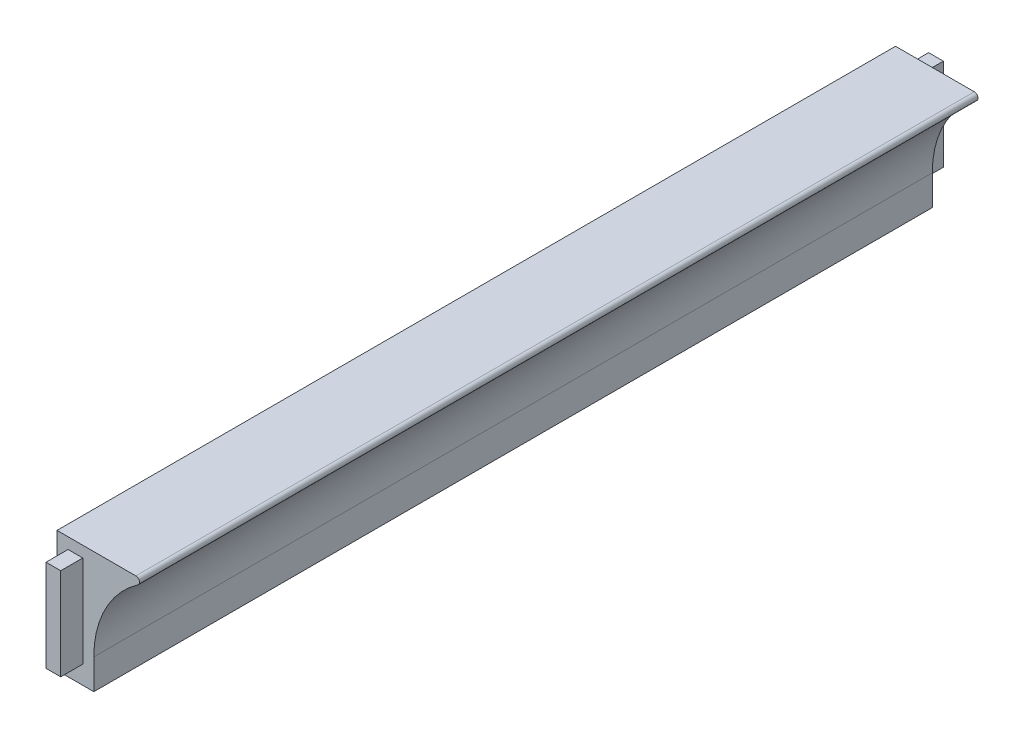
ISO-10303-21;
HEADER;
FILE_DESCRIPTION(('STEP AP214'),'2;1');
FILE_NAME('part.step','',(''),(''),'','','');
FILE_SCHEMA(('AUTOMOTIVE_DESIGN { 1 0 10303 214 1 1 1 1 }'));
ENDSEC;
DATA;
#1=APPLICATION_CONTEXT('core data for automotive mechanical design processes');
#2=APPLICATION_PROTOCOL_DEFINITION('international standard','automotive_design',2000,#1);
#3=PRODUCT_CONTEXT('',#1,'mechanical');
#4=PRODUCT('Part','Part','',(#3));
#5=PRODUCT_RELATED_PRODUCT_CATEGORY('part','',(#4));
#6=PRODUCT_DEFINITION_FORMATION('','',#4);
#7=PRODUCT_DEFINITION_CONTEXT('part definition',#1,'design');
#8=PRODUCT_DEFINITION('design','',#6,#7);
#9=PRODUCT_DEFINITION_SHAPE('','',#8);
#10=(LENGTH_UNIT() NAMED_UNIT(*) SI_UNIT(.MILLI.,.METRE.));
#11=(NAMED_UNIT(*) PLANE_ANGLE_UNIT() SI_UNIT($,.RADIAN.));
#12=(NAMED_UNIT(*) SI_UNIT($,.STERADIAN.) SOLID_ANGLE_UNIT());
#13=UNCERTAINTY_MEASURE_WITH_UNIT(LENGTH_MEASURE(1.E-05),#10,'distance_accuracy_value','');
#14=(GEOMETRIC_REPRESENTATION_CONTEXT(3) GLOBAL_UNCERTAINTY_ASSIGNED_CONTEXT((#13)) GLOBAL_UNIT_ASSIGNED_CONTEXT((#10,
#11,#12)) REPRESENTATION_CONTEXT('',''));
#15=CARTESIAN_POINT('',(0.,0.,0.));
#16=DIRECTION('',(0.,0.,1.));
#17=DIRECTION('',(1.,0.,0.));
#18=AXIS2_PLACEMENT_3D('',#15,#16,#17);
#19=CARTESIAN_POINT('',(0.,0.,120.));
#20=DIRECTION('',(0.,0.,1.));
#21=DIRECTION('',(1.,0.,0.));
#22=AXIS2_PLACEMENT_3D('',#19,#20,#21);
#23=PLANE('',#22);
#24=DIRECTION('',(0.,-1.,0.));
#25=VECTOR('',#24,1.);
#26=CARTESIAN_POINT('',(-18.,-3.,120.));
#27=LINE('',#26,#25);
#28=CARTESIAN_POINT('',(-18.,-28.,120.));
#29=VERTEX_POINT('',#28);
#30=CARTESIAN_POINT('',(-18.,-3.,120.));
#31=VERTEX_POINT('',#30);
#32=EDGE_CURVE('E214',#29,#31,#27,.F.);
#33=ORIENTED_EDGE('',*,*,#32,.T.);
#34=DIRECTION('',(1.,0.,0.));
#35=VECTOR('',#34,1.);
#36=CARTESIAN_POINT('',(-22.,-3.,120.));
#37=LINE('',#36,#35);
#38=CARTESIAN_POINT('',(-22.,-3.,120.));
#39=VERTEX_POINT('',#38);
#40=EDGE_CURVE('E209',#31,#39,#37,.F.);
#41=ORIENTED_EDGE('',*,*,#40,.T.);
#42=DIRECTION('',(0.,1.,0.));
#43=VECTOR('',#42,1.);
#44=CARTESIAN_POINT('',(-22.,-3.,120.));
#45=LINE('',#44,#43);
#46=CARTESIAN_POINT('',(-22.,-28.,120.));
#47=VERTEX_POINT('',#46);
#48=EDGE_CURVE('E203',#39,#47,#45,.F.);
#49=ORIENTED_EDGE('',*,*,#48,.T.);
#50=DIRECTION('',(1.,0.,0.));
#51=VECTOR('',#50,1.);
#52=CARTESIAN_POINT('',(-22.,-28.,120.));
#53=LINE('',#52,#51);
#54=EDGE_CURVE('E219',#47,#29,#53,.T.);
#55=ORIENTED_EDGE('',*,*,#54,.T.);
#56=EDGE_LOOP('',(#33,#41,#49,#55));
#57=FACE_BOUND('',#56,.T.);
#58=ADVANCED_FACE('F17',(#57),#23,.T.);
#59=CARTESIAN_POINT('',(0.,0.,-120.));
#60=DIRECTION('',(0.,0.,-1.));
#61=DIRECTION('',(-1.,0.,0.));
#62=AXIS2_PLACEMENT_3D('',#59,#60,#61);
#63=PLANE('',#62);
#64=DIRECTION('',(0.,1.,0.));
#65=VECTOR('',#64,1.);
#66=CARTESIAN_POINT('',(-18.,-3.,-120.));
#67=LINE('',#66,#65);
#68=CARTESIAN_POINT('',(-18.,-28.,-120.));
#69=VERTEX_POINT('',#68);
#70=CARTESIAN_POINT('',(-18.,-3.,-120.));
#71=VERTEX_POINT('',#70);
#72=EDGE_CURVE('E176',#69,#71,#67,.T.);
#73=ORIENTED_EDGE('',*,*,#72,.F.);
#74=DIRECTION('',(1.,0.,0.));
#75=VECTOR('',#74,1.);
#76=CARTESIAN_POINT('',(-22.,-28.,-120.));
#77=LINE('',#76,#75);
#78=CARTESIAN_POINT('',(-22.,-28.,-120.));
#79=VERTEX_POINT('',#78);
#80=EDGE_CURVE('E181',#79,#69,#77,.T.);
#81=ORIENTED_EDGE('',*,*,#80,.F.);
#82=DIRECTION('',(0.,-1.,0.));
#83=VECTOR('',#82,1.);
#84=CARTESIAN_POINT('',(-22.,-3.,-120.));
#85=LINE('',#84,#83);
#86=CARTESIAN_POINT('',(-22.,-3.,-120.));
#87=VERTEX_POINT('',#86);
#88=EDGE_CURVE('E186',#87,#79,#85,.T.);
#89=ORIENTED_EDGE('',*,*,#88,.F.);
#90=DIRECTION('',(-1.,0.,0.));
#91=VECTOR('',#90,1.);
#92=CARTESIAN_POINT('',(-22.,-3.,-120.));
#93=LINE('',#92,#91);
#94=EDGE_CURVE('E171',#71,#87,#93,.T.);
#95=ORIENTED_EDGE('',*,*,#94,.F.);
#96=EDGE_LOOP('',(#73,#81,#89,#95));
#97=FACE_BOUND('',#96,.T.);
#98=ADVANCED_FACE('F327',(#97),#63,.T.);
#99=CARTESIAN_POINT('',(-22.,-28.,120.));
#100=DIRECTION('',(0.,1.,0.));
#101=DIRECTION('',(0.,0.,1.));
#102=AXIS2_PLACEMENT_3D('',#99,#100,#101);
#103=PLANE('',#102);
#104=DIRECTION('',(0.,0.,1.));
#105=VECTOR('',#104,1.);
#106=CARTESIAN_POINT('',(-18.,-28.,120.));
#107=LINE('',#106,#105);
#108=CARTESIAN_POINT('',(-18.,-28.,114.));
#109=VERTEX_POINT('',#108);
#110=EDGE_CURVE('E216',#109,#29,#107,.T.);
#111=ORIENTED_EDGE('',*,*,#110,.T.);
#112=ORIENTED_EDGE('',*,*,#54,.F.);
#113=DIRECTION('',(0.,0.,1.));
#114=VECTOR('',#113,1.);
#115=CARTESIAN_POINT('',(-22.,-28.,120.));
#116=LINE('',#115,#114);
#117=CARTESIAN_POINT('',(-22.,-28.,114.));
#118=VERTEX_POINT('',#117);
#119=EDGE_CURVE('E188',#47,#118,#116,.F.);
#120=ORIENTED_EDGE('',*,*,#119,.T.);
#121=DIRECTION('',(-1.,0.,0.));
#122=VECTOR('',#121,1.);
#123=CARTESIAN_POINT('',(13.,-28.,114.));
#124=LINE('',#123,#122);
#125=EDGE_CURVE('E136',#118,#109,#124,.F.);
#126=ORIENTED_EDGE('',*,*,#125,.T.);
#127=EDGE_LOOP('',(#111,#112,#120,#126));
#128=FACE_BOUND('',#127,.T.);
#129=ADVANCED_FACE('F251',(#128),#103,.F.);
#130=CARTESIAN_POINT('',(-18.,-3.,120.));
#131=DIRECTION('',(-1.,0.,0.));
#132=DIRECTION('',(0.,-1.,0.));
#133=AXIS2_PLACEMENT_3D('',#130,#131,#132);
#134=PLANE('',#133);
#135=DIRECTION('',(0.,0.,1.));
#136=VECTOR('',#135,1.);
#137=CARTESIAN_POINT('',(-18.,-3.,120.));
#138=LINE('',#137,#136);
#139=CARTESIAN_POINT('',(-18.,-3.,114.));
#140=VERTEX_POINT('',#139);
#141=EDGE_CURVE('E211',#140,#31,#138,.T.);
#142=ORIENTED_EDGE('',*,*,#141,.T.);
#143=ORIENTED_EDGE('',*,*,#32,.F.);
#144=ORIENTED_EDGE('',*,*,#110,.F.);
#145=DIRECTION('',(0.,1.,0.));
#146=VECTOR('',#145,1.);
#147=CARTESIAN_POINT('',(-18.,-24.7991935352745,114.));
#148=LINE('',#147,#146);
#149=EDGE_CURVE('E245',#109,#140,#148,.T.);
#150=ORIENTED_EDGE('',*,*,#149,.T.);
#151=EDGE_LOOP('',(#142,#143,#144,#150));
#152=FACE_BOUND('',#151,.T.);
#153=ADVANCED_FACE('F260',(#152),#134,.F.);
#154=CARTESIAN_POINT('',(-22.,-3.,120.));
#155=DIRECTION('',(0.,-1.,0.));
#156=DIRECTION('',(1.,0.,0.));
#157=AXIS2_PLACEMENT_3D('',#154,#155,#156);
#158=PLANE('',#157);
#159=DIRECTION('',(0.,0.,1.));
#160=VECTOR('',#159,1.);
#161=CARTESIAN_POINT('',(-22.,-3.,120.));
#162=LINE('',#161,#160);
#163=CARTESIAN_POINT('',(-22.,-3.,114.));
#164=VERTEX_POINT('',#163);
#165=EDGE_CURVE('E206',#164,#39,#162,.T.);
#166=ORIENTED_EDGE('',*,*,#165,.T.);
#167=ORIENTED_EDGE('',*,*,#40,.F.);
#168=ORIENTED_EDGE('',*,*,#141,.F.);
#169=DIRECTION('',(-1.,0.,0.));
#170=VECTOR('',#169,1.);
#171=CARTESIAN_POINT('',(13.,-3.,114.));
#172=LINE('',#171,#170);
#173=EDGE_CURVE('E243',#140,#164,#172,.T.);
#174=ORIENTED_EDGE('',*,*,#173,.T.);
#175=EDGE_LOOP('',(#166,#167,#168,#174));
#176=FACE_BOUND('',#175,.T.);
#177=ADVANCED_FACE('F257',(#176),#158,.F.);
#178=CARTESIAN_POINT('',(-22.,-3.,120.));
#179=DIRECTION('',(1.,0.,0.));
#180=DIRECTION('',(0.,1.,0.));
#181=AXIS2_PLACEMENT_3D('',#178,#179,#180);
#182=PLANE('',#181);
#183=ORIENTED_EDGE('',*,*,#119,.F.);
#184=ORIENTED_EDGE('',*,*,#48,.F.);
#185=ORIENTED_EDGE('',*,*,#165,.F.);
#186=DIRECTION('',(0.,1.,0.));
#187=VECTOR('',#186,1.);
#188=CARTESIAN_POINT('',(-22.,-24.7991935352745,114.));
#189=LINE('',#188,#187);
#190=EDGE_CURVE('E190',#164,#118,#189,.F.);
#191=ORIENTED_EDGE('',*,*,#190,.T.);
#192=EDGE_LOOP('',(#183,#184,#185,#191));
#193=FACE_BOUND('',#192,.T.);
#194=ADVANCED_FACE('F264',(#193),#182,.F.);
#195=CARTESIAN_POINT('',(-22.,-3.,-120.));
#196=DIRECTION('',(-1.,0.,0.));
#197=DIRECTION('',(0.,-1.,0.));
#198=AXIS2_PLACEMENT_3D('',#195,#196,#197);
#199=PLANE('',#198);
#200=ORIENTED_EDGE('',*,*,#88,.T.);
#201=DIRECTION('',(0.,0.,-1.));
#202=VECTOR('',#201,1.);
#203=CARTESIAN_POINT('',(-22.,-28.,-120.));
#204=LINE('',#203,#202);
#205=CARTESIAN_POINT('',(-22.,-28.,-114.));
#206=VERTEX_POINT('',#205);
#207=EDGE_CURVE('E183',#206,#79,#204,.T.);
#208=ORIENTED_EDGE('',*,*,#207,.F.);
#209=DIRECTION('',(0.,1.,0.));
#210=VECTOR('',#209,1.);
#211=CARTESIAN_POINT('',(-22.,-24.7991935352745,-114.));
#212=LINE('',#211,#210);
#213=CARTESIAN_POINT('',(-22.,-3.,-114.));
#214=VERTEX_POINT('',#213);
#215=EDGE_CURVE('E154',#214,#206,#212,.F.);
#216=ORIENTED_EDGE('',*,*,#215,.F.);
#217=DIRECTION('',(0.,0.,1.));
#218=VECTOR('',#217,1.);
#219=CARTESIAN_POINT('',(-22.,-3.,-120.));
#220=LINE('',#219,#218);
#221=EDGE_CURVE('E128',#87,#214,#220,.T.);
#222=ORIENTED_EDGE('',*,*,#221,.F.);
#223=EDGE_LOOP('',(#200,#208,#216,#222));
#224=FACE_BOUND('',#223,.T.);
#225=ADVANCED_FACE('F266',(#224),#199,.T.);
#226=CARTESIAN_POINT('',(-22.,-28.,-120.));
#227=DIRECTION('',(0.,-1.,0.));
#228=DIRECTION('',(0.,0.,-1.));
#229=AXIS2_PLACEMENT_3D('',#226,#227,#228);
#230=PLANE('',#229);
#231=ORIENTED_EDGE('',*,*,#80,.T.);
#232=DIRECTION('',(0.,0.,1.));
#233=VECTOR('',#232,1.);
#234=CARTESIAN_POINT('',(-18.,-28.,-120.));
#235=LINE('',#234,#233);
#236=CARTESIAN_POINT('',(-18.,-28.,-114.));
#237=VERTEX_POINT('',#236);
#238=EDGE_CURVE('E178',#237,#69,#235,.F.);
#239=ORIENTED_EDGE('',*,*,#238,.F.);
#240=DIRECTION('',(-1.,0.,0.));
#241=VECTOR('',#240,1.);
#242=CARTESIAN_POINT('',(13.,-28.,-114.));
#243=LINE('',#242,#241);
#244=EDGE_CURVE('E238',#206,#237,#243,.F.);
#245=ORIENTED_EDGE('',*,*,#244,.F.);
#246=ORIENTED_EDGE('',*,*,#207,.T.);
#247=EDGE_LOOP('',(#231,#239,#245,#246));
#248=FACE_BOUND('',#247,.T.);
#249=ADVANCED_FACE('F273',(#248),#230,.T.);
#250=CARTESIAN_POINT('',(-18.,-3.,-120.));
#251=DIRECTION('',(1.,0.,0.));
#252=DIRECTION('',(0.,1.,0.));
#253=AXIS2_PLACEMENT_3D('',#250,#251,#252);
#254=PLANE('',#253);
#255=ORIENTED_EDGE('',*,*,#72,.T.);
#256=DIRECTION('',(0.,0.,1.));
#257=VECTOR('',#256,1.);
#258=CARTESIAN_POINT('',(-18.,-3.,-120.));
#259=LINE('',#258,#257);
#260=CARTESIAN_POINT('',(-18.,-3.,-114.));
#261=VERTEX_POINT('',#260);
#262=EDGE_CURVE('E173',#261,#71,#259,.F.);
#263=ORIENTED_EDGE('',*,*,#262,.F.);
#264=DIRECTION('',(0.,1.,0.));
#265=VECTOR('',#264,1.);
#266=CARTESIAN_POINT('',(-18.,-24.7991935352745,-114.));
#267=LINE('',#266,#265);
#268=EDGE_CURVE('E229',#237,#261,#267,.T.);
#269=ORIENTED_EDGE('',*,*,#268,.F.);
#270=ORIENTED_EDGE('',*,*,#238,.T.);
#271=EDGE_LOOP('',(#255,#263,#269,#270));
#272=FACE_BOUND('',#271,.T.);
#273=ADVANCED_FACE('F308',(#272),#254,.T.);
#274=CARTESIAN_POINT('',(-22.,-3.,-120.));
#275=DIRECTION('',(0.,1.,0.));
#276=DIRECTION('',(-1.,0.,0.));
#277=AXIS2_PLACEMENT_3D('',#274,#275,#276);
#278=PLANE('',#277);
#279=ORIENTED_EDGE('',*,*,#94,.T.);
#280=ORIENTED_EDGE('',*,*,#221,.T.);
#281=DIRECTION('',(-1.,0.,0.));
#282=VECTOR('',#281,1.);
#283=CARTESIAN_POINT('',(13.,-3.,-114.));
#284=LINE('',#283,#282);
#285=EDGE_CURVE('E225',#261,#214,#284,.T.);
#286=ORIENTED_EDGE('',*,*,#285,.F.);
#287=ORIENTED_EDGE('',*,*,#262,.T.);
#288=EDGE_LOOP('',(#279,#280,#286,#287));
#289=FACE_BOUND('',#288,.T.);
#290=ADVANCED_FACE('F305',(#289),#278,.T.);
#291=CARTESIAN_POINT('',(-3.57101044205058,-1.00000000000001,114.));
#292=DIRECTION('',(0.,0.,-1.));
#293=DIRECTION('',(-1.,0.,0.));
#294=AXIS2_PLACEMENT_3D('',#291,#292,#293);
#295=CYLINDRICAL_SURFACE('',#294,1.);
#296=CARTESIAN_POINT('',(-3.57101044205058,-1.00000000000001,-114.));
#297=DIRECTION('',(0.,0.,-1.));
#298=DIRECTION('',(-1.,0.,0.));
#299=AXIS2_PLACEMENT_3D('',#296,#297,#298);
#300=CIRCLE('',#299,1.);
#301=CARTESIAN_POINT('',(-3.57101044205058,0.,-114.));
#302=VERTEX_POINT('',#301);
#303=CARTESIAN_POINT('',(-2.99959628887642,-1.82066184604396,-114.));
#304=VERTEX_POINT('',#303);
#305=EDGE_CURVE('E222',#302,#304,#300,.T.);
#306=ORIENTED_EDGE('',*,*,#305,.F.);
#307=DIRECTION('',(0.,0.,1.));
#308=VECTOR('',#307,1.);
#309=CARTESIAN_POINT('',(-3.57101044205058,0.,114.));
#310=LINE('',#309,#308);
#311=CARTESIAN_POINT('',(-3.57101044205058,0.,114.));
#312=VERTEX_POINT('',#311);
#313=EDGE_CURVE('E114',#302,#312,#310,.T.);
#314=ORIENTED_EDGE('',*,*,#313,.T.);
#315=CARTESIAN_POINT('',(-3.57101044205058,-1.00000000000001,114.));
#316=DIRECTION('',(0.,0.,-1.));
#317=DIRECTION('',(-1.,0.,0.));
#318=AXIS2_PLACEMENT_3D('',#315,#316,#317);
#319=CIRCLE('',#318,1.);
#320=CARTESIAN_POINT('',(-2.99959628887642,-1.82066184604396,114.));
#321=VERTEX_POINT('',#320);
#322=EDGE_CURVE('E20',#312,#321,#319,.T.);
#323=ORIENTED_EDGE('',*,*,#322,.T.);
#324=DIRECTION('',(0.,0.,-1.));
#325=VECTOR('',#324,1.);
#326=CARTESIAN_POINT('',(-2.99959628887642,-1.82066184604396,114.));
#327=LINE('',#326,#325);
#328=EDGE_CURVE('E121',#321,#304,#327,.T.);
#329=ORIENTED_EDGE('',*,*,#328,.T.);
#330=EDGE_LOOP('',(#306,#314,#323,#329));
#331=FACE_BOUND('',#330,.T.);
#332=ADVANCED_FACE('F137',(#331),#295,.T.);
#333=CARTESIAN_POINT('',(13.,-24.7991935352745,114.));
#334=DIRECTION('',(0.,0.,-1.));
#335=DIRECTION('',(-1.,0.,0.));
#336=AXIS2_PLACEMENT_3D('',#333,#334,#335);
#337=CYLINDRICAL_SURFACE('',#336,28.);
#338=ORIENTED_EDGE('',*,*,#328,.F.);
#339=CARTESIAN_POINT('',(13.,-24.7991935352745,114.));
#340=DIRECTION('',(0.,0.,-1.));
#341=DIRECTION('',(-1.,0.,0.));
#342=AXIS2_PLACEMENT_3D('',#339,#340,#341);
#343=CIRCLE('',#342,28.);
#344=CARTESIAN_POINT('',(-15.,-24.7991935352745,114.));
#345=VERTEX_POINT('',#344);
#346=EDGE_CURVE('E125',#321,#345,#343,.F.);
#347=ORIENTED_EDGE('',*,*,#346,.T.);
#348=DIRECTION('',(0.,0.,1.));
#349=VECTOR('',#348,1.);
#350=CARTESIAN_POINT('',(-15.,-24.7991935352745,114.));
#351=LINE('',#350,#349);
#352=CARTESIAN_POINT('',(-15.,-24.7991935352745,-114.));
#353=VERTEX_POINT('',#352);
#354=EDGE_CURVE('E127',#345,#353,#351,.F.);
#355=ORIENTED_EDGE('',*,*,#354,.T.);
#356=CARTESIAN_POINT('',(13.,-24.7991935352745,-114.));
#357=DIRECTION('',(0.,0.,-1.));
#358=DIRECTION('',(-1.,0.,0.));
#359=AXIS2_PLACEMENT_3D('',#356,#357,#358);
#360=CIRCLE('',#359,28.);
#361=EDGE_CURVE('E126',#304,#353,#360,.F.);
#362=ORIENTED_EDGE('',*,*,#361,.F.);
#363=EDGE_LOOP('',(#338,#347,#355,#362));
#364=FACE_BOUND('',#363,.T.);
#365=ADVANCED_FACE('F123',(#364),#337,.F.);
#366=CARTESIAN_POINT('',(-15.,-33.,114.));
#367=DIRECTION('',(-1.,0.,0.));
#368=DIRECTION('',(0.,0.,1.));
#369=AXIS2_PLACEMENT_3D('',#366,#367,#368);
#370=PLANE('',#369);
#371=ORIENTED_EDGE('',*,*,#354,.F.);
#372=DIRECTION('',(0.,1.,0.));
#373=VECTOR('',#372,1.);
#374=CARTESIAN_POINT('',(-15.,-24.7991935352745,114.));
#375=LINE('',#374,#373);
#376=CARTESIAN_POINT('',(-15.,-33.,114.));
#377=VERTEX_POINT('',#376);
#378=EDGE_CURVE('E135',#345,#377,#375,.F.);
#379=ORIENTED_EDGE('',*,*,#378,.T.);
#380=DIRECTION('',(0.,0.,1.));
#381=VECTOR('',#380,1.);
#382=CARTESIAN_POINT('',(-15.,-33.,114.));
#383=LINE('',#382,#381);
#384=CARTESIAN_POINT('',(-15.,-33.,-114.));
#385=VERTEX_POINT('',#384);
#386=EDGE_CURVE('E151',#377,#385,#383,.F.);
#387=ORIENTED_EDGE('',*,*,#386,.T.);
#388=DIRECTION('',(0.,1.,0.));
#389=VECTOR('',#388,1.);
#390=CARTESIAN_POINT('',(-15.,-24.7991935352745,-114.));
#391=LINE('',#390,#389);
#392=EDGE_CURVE('E160',#353,#385,#391,.F.);
#393=ORIENTED_EDGE('',*,*,#392,.F.);
#394=EDGE_LOOP('',(#371,#379,#387,#393));
#395=FACE_BOUND('',#394,.T.);
#396=ADVANCED_FACE('F297',(#395),#370,.F.);
#397=CARTESIAN_POINT('',(0.,0.,114.));
#398=DIRECTION('',(0.,-1.,0.));
#399=DIRECTION('',(1.,0.,0.));
#400=AXIS2_PLACEMENT_3D('',#397,#398,#399);
#401=PLANE('',#400);
#402=ORIENTED_EDGE('',*,*,#313,.F.);
#403=DIRECTION('',(-1.,0.,0.));
#404=VECTOR('',#403,1.);
#405=CARTESIAN_POINT('',(13.,0.,-114.));
#406=LINE('',#405,#404);
#407=CARTESIAN_POINT('',(-25.,0.,-114.));
#408=VERTEX_POINT('',#407);
#409=EDGE_CURVE('E223',#408,#302,#406,.F.);
#410=ORIENTED_EDGE('',*,*,#409,.F.);
#411=DIRECTION('',(0.,0.,1.));
#412=VECTOR('',#411,1.);
#413=CARTESIAN_POINT('',(-25.,0.,114.));
#414=LINE('',#413,#412);
#415=CARTESIAN_POINT('',(-25.,0.,114.));
#416=VERTEX_POINT('',#415);
#417=EDGE_CURVE('E159',#408,#416,#414,.T.);
#418=ORIENTED_EDGE('',*,*,#417,.T.);
#419=DIRECTION('',(-1.,0.,0.));
#420=VECTOR('',#419,1.);
#421=CARTESIAN_POINT('',(13.,0.,114.));
#422=LINE('',#421,#420);
#423=EDGE_CURVE('E138',#416,#312,#422,.F.);
#424=ORIENTED_EDGE('',*,*,#423,.T.);
#425=EDGE_LOOP('',(#402,#410,#418,#424));
#426=FACE_BOUND('',#425,.T.);
#427=ADVANCED_FACE('F294',(#426),#401,.F.);
#428=CARTESIAN_POINT('',(13.,-24.7991935352745,114.));
#429=DIRECTION('',(0.,0.,-1.));
#430=DIRECTION('',(-1.,0.,0.));
#431=AXIS2_PLACEMENT_3D('',#428,#429,#430);
#432=PLANE('',#431);
#433=ORIENTED_EDGE('',*,*,#173,.F.);
#434=ORIENTED_EDGE('',*,*,#149,.F.);
#435=ORIENTED_EDGE('',*,*,#125,.F.);
#436=ORIENTED_EDGE('',*,*,#190,.F.);
#437=EDGE_LOOP('',(#433,#434,#435,#436));
#438=FACE_BOUND('',#437,.T.);
#439=ORIENTED_EDGE('',*,*,#322,.F.);
#440=ORIENTED_EDGE('',*,*,#423,.F.);
#441=DIRECTION('',(0.,1.,0.));
#442=VECTOR('',#441,1.);
#443=CARTESIAN_POINT('',(-25.,0.,114.));
#444=LINE('',#443,#442);
#445=CARTESIAN_POINT('',(-25.,-33.,114.));
#446=VERTEX_POINT('',#445);
#447=EDGE_CURVE('E165',#416,#446,#444,.F.);
#448=ORIENTED_EDGE('',*,*,#447,.T.);
#449=DIRECTION('',(1.,0.,0.));
#450=VECTOR('',#449,1.);
#451=CARTESIAN_POINT('',(-25.,-33.,114.));
#452=LINE('',#451,#450);
#453=EDGE_CURVE('E155',#446,#377,#452,.T.);
#454=ORIENTED_EDGE('',*,*,#453,.T.);
#455=ORIENTED_EDGE('',*,*,#378,.F.);
#456=ORIENTED_EDGE('',*,*,#346,.F.);
#457=EDGE_LOOP('',(#439,#440,#448,#454,#455,#456));
#458=FACE_BOUND('',#457,.T.);
#459=ADVANCED_FACE('F132',(#438,#458),#432,.F.);
#460=CARTESIAN_POINT('',(-25.,-33.,114.));
#461=DIRECTION('',(0.,1.,0.));
#462=DIRECTION('',(0.,0.,1.));
#463=AXIS2_PLACEMENT_3D('',#460,#461,#462);
#464=PLANE('',#463);
#465=ORIENTED_EDGE('',*,*,#386,.F.);
#466=ORIENTED_EDGE('',*,*,#453,.F.);
#467=DIRECTION('',(0.,0.,1.));
#468=VECTOR('',#467,1.);
#469=CARTESIAN_POINT('',(-25.,-33.,114.));
#470=LINE('',#469,#468);
#471=CARTESIAN_POINT('',(-25.,-33.,-114.));
#472=VERTEX_POINT('',#471);
#473=EDGE_CURVE('E26',#446,#472,#470,.F.);
#474=ORIENTED_EDGE('',*,*,#473,.T.);
#475=DIRECTION('',(-1.,0.,0.));
#476=VECTOR('',#475,1.);
#477=CARTESIAN_POINT('',(13.,-33.,-114.));
#478=LINE('',#477,#476);
#479=EDGE_CURVE('E34',#385,#472,#478,.T.);
#480=ORIENTED_EDGE('',*,*,#479,.F.);
#481=EDGE_LOOP('',(#465,#466,#474,#480));
#482=FACE_BOUND('',#481,.T.);
#483=ADVANCED_FACE('F285',(#482),#464,.F.);
#484=CARTESIAN_POINT('',(13.,-24.7991935352745,-114.));
#485=DIRECTION('',(0.,0.,-1.));
#486=DIRECTION('',(-1.,0.,0.));
#487=AXIS2_PLACEMENT_3D('',#484,#485,#486);
#488=PLANE('',#487);
#489=ORIENTED_EDGE('',*,*,#479,.T.);
#490=DIRECTION('',(0.,1.,0.));
#491=VECTOR('',#490,1.);
#492=CARTESIAN_POINT('',(-25.,0.,-114.));
#493=LINE('',#492,#491);
#494=EDGE_CURVE('E11',#472,#408,#493,.T.);
#495=ORIENTED_EDGE('',*,*,#494,.T.);
#496=ORIENTED_EDGE('',*,*,#409,.T.);
#497=ORIENTED_EDGE('',*,*,#305,.T.);
#498=ORIENTED_EDGE('',*,*,#361,.T.);
#499=ORIENTED_EDGE('',*,*,#392,.T.);
#500=EDGE_LOOP('',(#489,#495,#496,#497,#498,#499));
#501=FACE_BOUND('',#500,.T.);
#502=ORIENTED_EDGE('',*,*,#268,.T.);
#503=ORIENTED_EDGE('',*,*,#285,.T.);
#504=ORIENTED_EDGE('',*,*,#215,.T.);
#505=ORIENTED_EDGE('',*,*,#244,.T.);
#506=EDGE_LOOP('',(#502,#503,#504,#505));
#507=FACE_BOUND('',#506,.T.);
#508=ADVANCED_FACE('F279',(#501,#507),#488,.T.);
#509=CARTESIAN_POINT('',(-25.,0.,114.));
#510=DIRECTION('',(1.,0.,0.));
#511=DIRECTION('',(0.,1.,0.));
#512=AXIS2_PLACEMENT_3D('',#509,#510,#511);
#513=PLANE('',#512);
#514=ORIENTED_EDGE('',*,*,#473,.F.);
#515=ORIENTED_EDGE('',*,*,#447,.F.);
#516=ORIENTED_EDGE('',*,*,#417,.F.);
#517=ORIENTED_EDGE('',*,*,#494,.F.);
#518=EDGE_LOOP('',(#514,#515,#516,#517));
#519=FACE_BOUND('',#518,.T.);
#520=ADVANCED_FACE('F277',(#519),#513,.F.);
#521=CLOSED_SHELL('',(#58,#98,#129,#153,#177,#194,#225,#249,#273,#290,#332,#365,#396,#427,#459,
#483,#508,#520));
#522=MANIFOLD_SOLID_BREP('B1',#521);
#523=ADVANCED_BREP_SHAPE_REPRESENTATION('',(#18,#522),#14);
#524=SHAPE_DEFINITION_REPRESENTATION(#9,#523);
ENDSEC;
END-ISO-10303-21;
